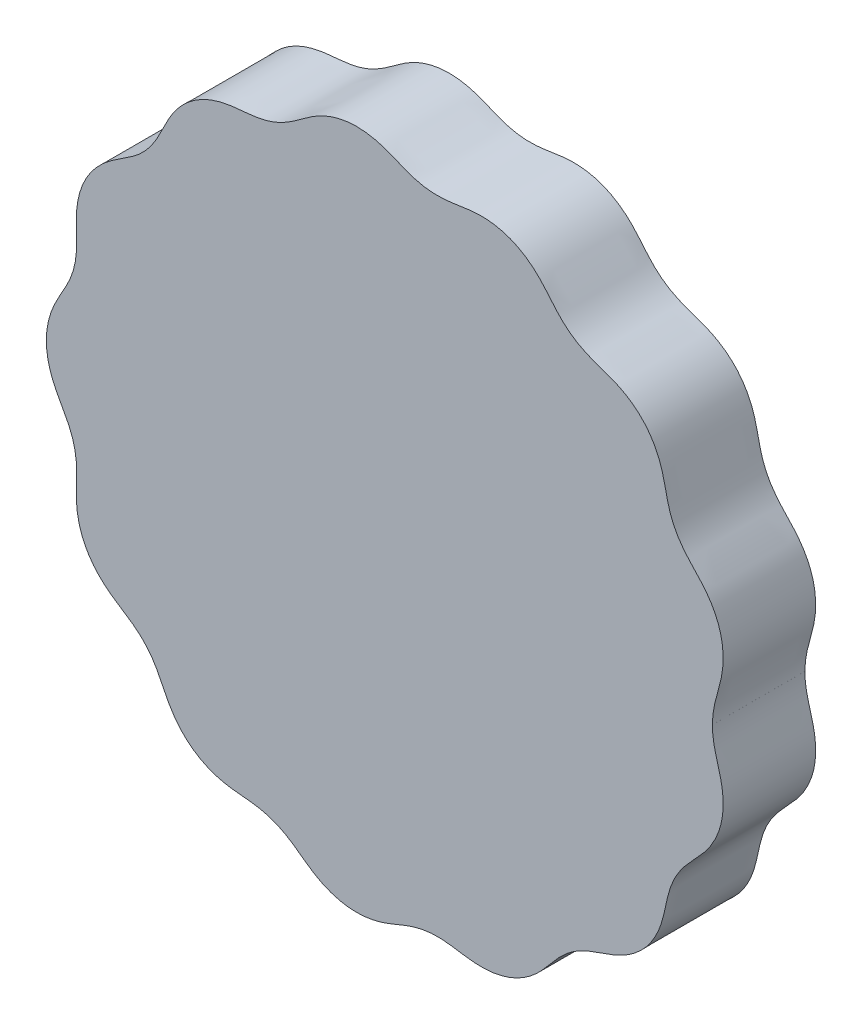
ISO-10303-21;
HEADER;
FILE_DESCRIPTION(('STEP AP214'),'2;1');
FILE_NAME('part.step','',(''),(''),'','','');
FILE_SCHEMA(('AUTOMOTIVE_DESIGN { 1 0 10303 214 1 1 1 1 }'));
ENDSEC;
DATA;
#1=APPLICATION_CONTEXT('core data for automotive mechanical design processes');
#2=APPLICATION_PROTOCOL_DEFINITION('international standard','automotive_design',2000,#1);
#3=PRODUCT_CONTEXT('',#1,'mechanical');
#4=PRODUCT('Part','Part','',(#3));
#5=PRODUCT_RELATED_PRODUCT_CATEGORY('part','',(#4));
#6=PRODUCT_DEFINITION_FORMATION('','',#4);
#7=PRODUCT_DEFINITION_CONTEXT('part definition',#1,'design');
#8=PRODUCT_DEFINITION('design','',#6,#7);
#9=PRODUCT_DEFINITION_SHAPE('','',#8);
#10=(LENGTH_UNIT() NAMED_UNIT(*) SI_UNIT(.MILLI.,.METRE.));
#11=(NAMED_UNIT(*) PLANE_ANGLE_UNIT() SI_UNIT($,.RADIAN.));
#12=(NAMED_UNIT(*) SI_UNIT($,.STERADIAN.) SOLID_ANGLE_UNIT());
#13=UNCERTAINTY_MEASURE_WITH_UNIT(LENGTH_MEASURE(1.E-05),#10,'distance_accuracy_value','');
#14=(GEOMETRIC_REPRESENTATION_CONTEXT(3) GLOBAL_UNCERTAINTY_ASSIGNED_CONTEXT((#13)) GLOBAL_UNIT_ASSIGNED_CONTEXT((#10,
#11,#12)) REPRESENTATION_CONTEXT('',''));
#15=CARTESIAN_POINT('',(0.,0.,0.));
#16=DIRECTION('',(0.,0.,1.));
#17=DIRECTION('',(1.,0.,0.));
#18=AXIS2_PLACEMENT_3D('',#15,#16,#17);
#19=CARTESIAN_POINT('',(35.,2.17512996089608E-13,10.));
#20=DIRECTION('',(-0.999999955000063,0.000299999786882255,0.));
#21=DIRECTION('',(-0.000299999786882255,-0.999999955000063,0.));
#22=AXIS2_PLACEMENT_3D('',#19,#20,#21);
#23=PLANE('',#22);
#24=CARTESIAN_POINT('',(35.,2.17512996089608E-13,0.));
#25=CARTESIAN_POINT('',(35.0000014999983,0.00499999781969133,0.));
#26=B_SPLINE_CURVE_WITH_KNOTS('',1,(#24,#25),.UNSPECIFIED.,.F.,.F.,(2,2),(0.,1.),.UNSPECIFIED.);
#27=CARTESIAN_POINT('',(35.,2.17512996089608E-13,0.));
#28=VERTEX_POINT('',#27);
#29=CARTESIAN_POINT('',(35.0000014999983,0.00499999782795079,0.));
#30=VERTEX_POINT('',#29);
#31=EDGE_CURVE('E78',#28,#30,#26,.T.);
#32=ORIENTED_EDGE('',*,*,#31,.T.);
#33=DIRECTION('',(0.,0.,-1.));
#34=VECTOR('',#33,1.);
#35=CARTESIAN_POINT('',(35.0000014999983,0.00499999782795079,10.));
#36=LINE('',#35,#34);
#37=CARTESIAN_POINT('',(35.0000014999983,0.00499999782795079,10.));
#38=VERTEX_POINT('',#37);
#39=EDGE_CURVE('E11',#38,#30,#36,.T.);
#40=ORIENTED_EDGE('',*,*,#39,.F.);
#41=CARTESIAN_POINT('',(35.,2.17512996089608E-13,10.));
#42=CARTESIAN_POINT('',(35.0000014999983,0.00499999781969133,10.));
#43=B_SPLINE_CURVE_WITH_KNOTS('',1,(#41,#42),.UNSPECIFIED.,.F.,.F.,(2,2),(0.,1.),.UNSPECIFIED.);
#44=CARTESIAN_POINT('',(35.,2.17512996089608E-13,10.));
#45=VERTEX_POINT('',#44);
#46=EDGE_CURVE('E77',#45,#38,#43,.T.);
#47=ORIENTED_EDGE('',*,*,#46,.F.);
#48=DIRECTION('',(0.,0.,-1.));
#49=VECTOR('',#48,1.);
#50=CARTESIAN_POINT('',(35.,2.17512996089608E-13,10.));
#51=LINE('',#50,#49);
#52=EDGE_CURVE('E54',#45,#28,#51,.T.);
#53=ORIENTED_EDGE('',*,*,#52,.T.);
#54=EDGE_LOOP('',(#32,#40,#47,#53));
#55=FACE_BOUND('',#54,.T.);
#56=ADVANCED_FACE('F45',(#55),#23,.F.);
#57=CARTESIAN_POINT('',(35.0000014999983,0.00499999782795079,10.));
#58=CARTESIAN_POINT('',(35.0000310864618,0.0543108155195717,10.));
#59=CARTESIAN_POINT('',(35.0009025407844,0.128549060653493,10.));
#60=CARTESIAN_POINT('',(35.0037411347304,0.265908238096289,10.));
#61=CARTESIAN_POINT('',(35.0112683029075,0.448861583052946,10.));
#62=CARTESIAN_POINT('',(35.0220480814165,0.620168406201716,10.));
#63=CARTESIAN_POINT('',(35.0442367557875,0.884014257720386,10.));
#64=CARTESIAN_POINT('',(35.0862856779514,1.23397754887106,10.));
#65=CARTESIAN_POINT('',(35.1523441183875,1.63943468512376,10.));
#66=CARTESIAN_POINT('',(35.2480692150812,2.09944703597927,10.));
#67=CARTESIAN_POINT('',(35.3875729991291,2.66962897608304,10.));
#68=CARTESIAN_POINT('',(35.5718921271036,3.3319542435631,10.));
#69=CARTESIAN_POINT('',(35.7869402357076,4.0898074605208,10.));
#70=CARTESIAN_POINT('',(35.9915566398992,4.95474960359177,10.));
#71=CARTESIAN_POINT('',(36.1284446900114,5.81623189838863,10.));
#72=CARTESIAN_POINT('',(36.182876803988,6.63884940584036,10.));
#73=CARTESIAN_POINT('',(36.1626584016344,7.4146536717609,10.));
#74=CARTESIAN_POINT('',(36.080240472637,8.13764245164843,10.));
#75=CARTESIAN_POINT('',(35.948917033752,8.80433600647678,10.));
#76=CARTESIAN_POINT('',(35.7176418279966,9.62161868918746,10.));
#77=CARTESIAN_POINT('',(35.3354424499233,10.5680855593853,10.));
#78=CARTESIAN_POINT('',(34.7785264622724,11.5480214899174,10.));
#79=CARTESIAN_POINT('',(34.0308039915622,12.5244552342241,10.));
#80=CARTESIAN_POINT('',(33.2428665774803,13.3788345461627,10.));
#81=CARTESIAN_POINT('',(32.4828013554596,14.169074794182,10.));
#82=CARTESIAN_POINT('',(31.726496934877,15.0531498535634,10.));
#83=CARTESIAN_POINT('',(31.0436916666455,16.0782714437892,10.));
#84=CARTESIAN_POINT('',(30.5295786030727,17.1993933760943,10.));
#85=CARTESIAN_POINT('',(30.1816613252553,18.3792756298374,10.));
#86=CARTESIAN_POINT('',(29.9429912197308,19.5166123580088,10.));
#87=CARTESIAN_POINT('',(29.71326611424,20.5890199443362,10.));
#88=CARTESIAN_POINT('',(29.293876673344,22.0328632068651,10.));
#89=CARTESIAN_POINT('',(28.4595191507792,23.7627677170157,10.));
#90=CARTESIAN_POINT('',(27.1929466300125,25.2322472754577,10.));
#91=CARTESIAN_POINT('',(25.6089374617144,26.3101838573324,10.));
#92=CARTESIAN_POINT('',(24.2456821647143,26.927775953026,10.));
#93=CARTESIAN_POINT('',(23.2220104942948,27.2939568668243,10.));
#94=CARTESIAN_POINT('',(22.1052345497009,27.6653491268592,10.));
#95=CARTESIAN_POINT('',(20.9288841623815,28.1421706873889,10.));
#96=CARTESIAN_POINT('',(19.5935757182385,28.9216372845436,10.));
#97=CARTESIAN_POINT('',(18.4486380278207,29.9664881873426,10.));
#98=CARTESIAN_POINT('',(17.5362778913035,31.0896072459109,10.));
#99=CARTESIAN_POINT('',(16.6157446691518,32.1840877397335,10.));
#100=CARTESIAN_POINT('',(15.7429026297886,33.0588471513226,10.));
#101=CARTESIAN_POINT('',(14.7030224949892,33.8498035211526,10.));
#102=CARTESIAN_POINT('',(13.4889971741319,34.4966066035768,10.));
#103=CARTESIAN_POINT('',(12.1240086493383,34.9572968684681,10.));
#104=CARTESIAN_POINT('',(10.6342597314615,35.1865550577604,10.));
#105=CARTESIAN_POINT('',(9.22904618966915,35.1535374118458,10.));
#106=CARTESIAN_POINT('',(7.94378723991389,34.9680349230072,10.));
#107=CARTESIAN_POINT('',(6.83150352352526,34.7908186476337,10.));
#108=CARTESIAN_POINT('',(5.88134624445465,34.6858590626975,10.));
#109=CARTESIAN_POINT('',(4.7366208813196,34.6630149305843,10.));
#110=CARTESIAN_POINT('',(3.40894171938031,34.8257184399033,10.));
#111=CARTESIAN_POINT('',(1.91709374042729,35.2896089270988,10.));
#112=CARTESIAN_POINT('',(0.303798344952442,36.0279394548844,10.));
#113=CARTESIAN_POINT('',(-1.61842807113981,36.6998094454582,10.));
#114=CARTESIAN_POINT('',(-3.57344713106737,36.8979502976926,10.));
#115=CARTESIAN_POINT('',(-5.3930353257133,36.6450814600355,10.));
#116=CARTESIAN_POINT('',(-6.93090405326019,36.0791709130417,10.));
#117=CARTESIAN_POINT('',(-8.01365765132078,35.495538514688,10.));
#118=CARTESIAN_POINT('',(-8.97311262350877,34.8385784922628,10.));
#119=CARTESIAN_POINT('',(-9.84765265841585,34.177822985542,10.));
#120=CARTESIAN_POINT('',(-10.7975945743944,33.5073076721959,10.));
#121=CARTESIAN_POINT('',(-11.8722535878071,32.9062263168151,10.));
#122=CARTESIAN_POINT('',(-13.0285594035672,32.4759919455254,10.));
#123=CARTESIAN_POINT('',(-14.234143790567,32.2257725627894,10.));
#124=CARTESIAN_POINT('',(-15.390573103576,32.1053174925648,10.));
#125=CARTESIAN_POINT('',(-16.4835526577881,32.0177130648229,10.));
#126=CARTESIAN_POINT('',(-17.9732275202098,31.8219670874056,10.));
#127=CARTESIAN_POINT('',(-19.8157911706481,31.2832586366021,10.));
#128=CARTESIAN_POINT('',(-21.448087560462,30.2928390578204,10.));
#129=CARTESIAN_POINT('',(-22.7368070226648,28.9589014916297,10.));
#130=CARTESIAN_POINT('',(-23.5268276569515,27.795754617945,10.));
#131=CARTESIAN_POINT('',(-23.996782169516,26.9508418240897,10.));
#132=CARTESIAN_POINT('',(-24.4890243428845,25.9340854528209,10.));
#133=CARTESIAN_POINT('',(-25.052171961089,24.7708946898695,10.));
#134=CARTESIAN_POINT('',(-25.753304669946,23.6667541107942,10.));
#135=CARTESIAN_POINT('',(-26.6421141795922,22.6971158668361,10.));
#136=CARTESIAN_POINT('',(-27.5340060178717,21.9616914109461,10.));
#137=CARTESIAN_POINT('',(-28.3591252213195,21.3964246691871,10.));
#138=CARTESIAN_POINT('',(-29.3206482840517,20.7893626430089,10.));
#139=CARTESIAN_POINT('',(-30.3764522165791,20.0710476460752,10.));
#140=CARTESIAN_POINT('',(-31.4056318689637,19.164101965325,10.));
#141=CARTESIAN_POINT('',(-32.3230035783964,18.0254330987503,10.));
#142=CARTESIAN_POINT('',(-33.0105859424613,16.7916127293966,10.));
#143=CARTESIAN_POINT('',(-33.4724653062054,15.5087803291539,10.));
#144=CARTESIAN_POINT('',(-33.713735096596,14.2340463592534,10.));
#145=CARTESIAN_POINT('',(-33.7797135021145,13.0062514445877,10.));
#146=CARTESIAN_POINT('',(-33.7460081766283,11.8447409720605,10.));
#147=CARTESIAN_POINT('',(-33.7061868322671,10.748767552727,10.));
#148=CARTESIAN_POINT('',(-33.7453548751316,9.57581663609641,10.));
#149=CARTESIAN_POINT('',(-33.9459758463393,8.34033054946759,10.));
#150=CARTESIAN_POINT('',(-34.3420470547459,7.1565545424737,10.));
#151=CARTESIAN_POINT('',(-34.8935147152783,6.04683841636418,10.));
#152=CARTESIAN_POINT('',(-35.4726688918044,5.04513400400629,10.));
#153=CARTESIAN_POINT('',(-35.992316197492,4.10126209590537,10.));
#154=CARTESIAN_POINT('',(-36.6040444386442,2.74351990933526,10.));
#155=CARTESIAN_POINT('',(-37.0819615481045,0.893241810429942,10.));
#156=CARTESIAN_POINT('',(-37.0651350039162,-1.04416304398527,10.));
#157=CARTESIAN_POINT('',(-36.5515003787192,-2.89476510792298,10.));
#158=CARTESIAN_POINT('',(-35.9130270447585,-4.25590172670625,10.));
#159=CARTESIAN_POINT('',(-35.3755715468699,-5.21161152733351,10.));
#160=CARTESIAN_POINT('',(-34.7987224561679,-6.22019930081547,10.));
#161=CARTESIAN_POINT('',(-34.2723005947744,-7.33179919523578,10.));
#162=CARTESIAN_POINT('',(-33.9075518356997,-8.51006516940914,10.));
#163=CARTESIAN_POINT('',(-33.7328044584287,-9.72956587013439,10.));
#164=CARTESIAN_POINT('',(-33.708623438649,-10.8930201193704,10.));
#165=CARTESIAN_POINT('',(-33.7526262945537,-11.9888014539399,10.));
#166=CARTESIAN_POINT('',(-33.7783656643995,-13.15077461867,10.));
#167=CARTESIAN_POINT('',(-33.6954628951965,-14.3778126612138,10.));
#168=CARTESIAN_POINT('',(-33.4332534316111,-15.648473232854,10.));
#169=CARTESIAN_POINT('',(-32.9493812308427,-16.9232332157588,10.));
#170=CARTESIAN_POINT('',(-32.231699609788,-18.1599708416635,10.));
#171=CARTESIAN_POINT('',(-31.2694098423721,-19.3075517549116,10.));
#172=CARTESIAN_POINT('',(-30.1989188317438,-20.2070112138374,10.));
#173=CARTESIAN_POINT('',(-29.1172913065484,-20.9169002608777,10.));
#174=CARTESIAN_POINT('',(-28.1653383806955,-21.523253444333,10.));
#175=CARTESIAN_POINT('',(-27.3778660454546,-22.0817554417611,10.));
#176=CARTESIAN_POINT('',(-26.5068800093264,-22.8288074681,10.));
#177=CARTESIAN_POINT('',(-25.6287598356217,-23.8316114418076,10.));
#178=CARTESIAN_POINT('',(-24.8245788946458,-25.167993152194,10.));
#179=CARTESIAN_POINT('',(-24.1070186348831,-26.7907272245746,10.));
#180=CARTESIAN_POINT('',(-23.1071251701615,-28.5704572223174,10.));
#181=CARTESIAN_POINT('',(-21.7615407347717,-30.0159408107248,10.));
#182=CARTESIAN_POINT('',(-20.2223560264506,-31.0273581583187,10.));
#183=CARTESIAN_POINT('',(-18.6927494842547,-31.6153340136885,10.));
#184=CARTESIAN_POINT('',(-17.4939020890828,-31.8907234185412,10.));
#185=CARTESIAN_POINT('',(-16.33954540693,-32.0314221135062,10.));
#186=CARTESIAN_POINT('',(-15.2466267232609,-32.1164510182547,10.));
#187=CARTESIAN_POINT('',(-14.091231922898,-32.2480274741547,10.));
#188=CARTESIAN_POINT('',(-12.8896521444052,-32.5169765767396,10.));
#189=CARTESIAN_POINT('',(-11.7416066413377,-32.9683768241079,10.));
#190=CARTESIAN_POINT('',(-10.6765692212953,-33.5856849111498,10.));
#191=CARTESIAN_POINT('',(-9.73303998733823,-34.2648006268558,10.));
#192=CARTESIAN_POINT('',(-8.85632765246375,-34.9233351774222,10.));
#193=CARTESIAN_POINT('',(-7.60841069792694,-35.760261885803,10.));
#194=CARTESIAN_POINT('',(-5.86757614412619,-36.5696316309667,10.));
#195=CARTESIAN_POINT('',(-3.98951327993847,-36.8998605471362,10.));
#196=CARTESIAN_POINT('',(-2.14590416709129,-36.7469147483421,10.));
#197=CARTESIAN_POINT('',(-0.79144709462863,-36.3968340459103,10.));
#198=CARTESIAN_POINT('',(0.11112449024193,-36.0773040482213,10.));
#199=CARTESIAN_POINT('',(1.15146887092432,-35.6431763128395,10.));
#200=CARTESIAN_POINT('',(2.34898034039108,-35.1449725208596,10.));
#201=CARTESIAN_POINT('',(3.61171756825218,-34.7856814511564,10.));
#202=CARTESIAN_POINT('',(4.92526664045478,-34.654901605023,10.));
#203=CARTESIAN_POINT('',(6.07783996478705,-34.7001367287002,10.));
#204=CARTESIAN_POINT('',(7.060772067155,-34.824590111216,10.));
#205=CARTESIAN_POINT('',(8.18067682712421,-35.0073224475818,10.));
#206=CARTESIAN_POINT('',(9.45244591698825,-35.1689468055806,10.));
#207=CARTESIAN_POINT('',(11.1722758280691,-35.1687530312044,10.));
#208=CARTESIAN_POINT('',(12.97397742405,-34.7586949822555,10.));
#209=CARTESIAN_POINT('',(14.6039682442951,-33.9567953622201,10.));
#210=CARTESIAN_POINT('',(15.9108107588923,-32.9109898728797,10.));
#211=CARTESIAN_POINT('',(16.7749564682938,-32.0038355006133,10.));
#212=CARTESIAN_POINT('',(17.5068108935931,-31.1169611521332,10.));
#213=CARTESIAN_POINT('',(18.1792636699781,-30.3102649329796,10.));
#214=CARTESIAN_POINT('',(18.9903623654321,-29.4694486362523,10.));
#215=CARTESIAN_POINT('',(19.9984041020392,-28.6659749356962,10.));
#216=CARTESIAN_POINT('',(21.1226427369116,-28.0488785181959,10.));
#217=CARTESIAN_POINT('',(22.3082413168059,-27.5963092065576,10.));
#218=CARTESIAN_POINT('',(23.6325547646824,-27.1562463134082,10.));
#219=CARTESIAN_POINT('',(25.220785613855,-26.5521642518819,10.));
#220=CARTESIAN_POINT('',(27.0395117153579,-25.4116636844367,10.));
#221=CARTESIAN_POINT('',(28.4621756891948,-23.7586196925762,10.));
#222=CARTESIAN_POINT('',(29.2958038582495,-22.0281480879799,10.));
#223=CARTESIAN_POINT('',(29.7143741475314,-20.5841796613305,10.));
#224=CARTESIAN_POINT('',(29.9440040608247,-19.511701744421,10.));
#225=CARTESIAN_POINT('',(30.1828014144426,-18.3744208770754,10.));
#226=CARTESIAN_POINT('',(30.5313438936794,-17.1946828005679,10.));
#227=CARTESIAN_POINT('',(31.0461225137016,-16.0738793719032,10.));
#228=CARTESIAN_POINT('',(31.7295565739188,-15.0491651960089,10.));
#229=CARTESIAN_POINT('',(32.4861941931094,-14.165404540366,10.));
#230=CARTESIAN_POINT('',(33.2463637604059,-13.3752515933604,10.));
#231=CARTESIAN_POINT('',(33.9189763417439,-12.6454506473698,10.));
#232=CARTESIAN_POINT('',(34.4713135650359,-11.9491040909517,10.));
#233=CARTESIAN_POINT('',(34.9068670410096,-11.2974537143156,10.));
#234=CARTESIAN_POINT('',(35.2412742647242,-10.705998089152,10.));
#235=CARTESIAN_POINT('',(35.6002746812378,-9.93630286625626,10.));
#236=CARTESIAN_POINT('',(35.8755665725315,-9.13146148457562,10.));
#237=CARTESIAN_POINT('',(36.0618650684503,-8.30148007360115,10.));
#238=CARTESIAN_POINT('',(36.1629952014171,-7.40965964100821,10.));
#239=CARTESIAN_POINT('',(36.1827638728428,-6.63383724796177,10.));
#240=CARTESIAN_POINT('',(36.1278719749925,-5.81126275899116,10.));
#241=CARTESIAN_POINT('',(35.9905738114838,-4.94983765098203,10.));
#242=CARTESIAN_POINT('',(35.8127203748505,-4.19930319023177,10.));
#243=CARTESIAN_POINT('',(35.6346423525472,-3.55299844431831,10.));
#244=CARTESIAN_POINT('',(35.4806577472858,-3.0041630874605,10.));
#245=CARTESIAN_POINT('',(35.3584335685775,-2.55079150981114,10.));
#246=CARTESIAN_POINT('',(35.2469484750016,-2.09447422513157,10.));
#247=CARTESIAN_POINT('',(35.1633729243929,-1.69220335621169,10.));
#248=CARTESIAN_POINT('',(35.1043890938049,-1.34468882390954,10.));
#249=CARTESIAN_POINT('',(35.064644020595,-1.05422526503456,10.));
#250=CARTESIAN_POINT('',(35.0388223524986,-0.820246291414608,10.));
#251=CARTESIAN_POINT('',(35.0216800303736,-0.615246909389165,10.));
#252=CARTESIAN_POINT('',(35.0110017645867,-0.443866873314605,10.));
#253=CARTESIAN_POINT('',(35.0035833396059,-0.260905707937618,10.));
#254=CARTESIAN_POINT('',(35.0008269251787,-0.123549040932127,10.));
#255=CARTESIAN_POINT('',(35.,-0.0493109335059125,10.));
#256=CARTESIAN_POINT('',(35.,2.17512996089608E-13,10.));
#257=B_SPLINE_CURVE_WITH_KNOTS('',4,(#57,#58,#59,#60,#61,#62,#63,#64,#65,#66,#67,#68,#69,#70,
#71,#72,#73,#74,#75,#76,#77,#78,#79,#80,#81,#82,#83,#84,#85,#86,#87,#88,#89,#90,#91,#92,#93,#94,
#95,#96,#97,#98,#99,#100,#101,#102,#103,#104,#105,#106,#107,#108,#109,#110,#111,#112,#113,#114,
#115,#116,#117,#118,#119,#120,#121,#122,#123,#124,#125,#126,#127,#128,#129,#130,#131,#132,#133,
#134,#135,#136,#137,#138,#139,#140,#141,#142,#143,#144,#145,#146,#147,#148,#149,#150,#151,#152,
#153,#154,#155,#156,#157,#158,#159,#160,#161,#162,#163,#164,#165,#166,#167,#168,#169,#170,#171,
#172,#173,#174,#175,#176,#177,#178,#179,#180,#181,#182,#183,#184,#185,#186,#187,#188,#189,#190,
#191,#192,#193,#194,#195,#196,#197,#198,#199,#200,#201,#202,#203,#204,#205,#206,#207,#208,#209,
#210,#211,#212,#213,#214,#215,#216,#217,#218,#219,#220,#221,#222,#223,#224,#225,#226,#227,#228,
#229,#230,#231,#232,#233,#234,#235,#236,#237,#238,#239,#240,#241,#242,#243,#244,#245,#246,#247,
#248,#249,#250,#251,#252,#253,#254,#255,#256),.UNSPECIFIED.,.F.,.F.,(5,1,1,1,1,1,1,1,1,1,1,1,1,
1,1,1,1,1,1,1,1,1,1,1,1,1,1,1,1,1,1,1,1,1,1,1,1,1,1,1,1,1,1,1,1,1,1,1,1,1,1,1,1,1,1,1,1,1,1,1,1,
1,1,1,1,1,1,1,1,1,1,1,1,1,1,1,1,1,1,1,1,1,1,1,1,1,1,1,1,1,1,1,1,1,1,1,1,1,1,1,1,1,1,1,1,1,1,1,1,
1,1,1,1,1,1,1,1,1,1,1,1,1,1,1,1,1,1,1,1,1,1,1,1,1,1,1,1,1,1,1,1,1,1,1,1,1,1,1,1,1,1,1,1,1,1,1,1,
1,1,1,1,1,1,1,1,1,1,1,1,1,1,1,1,1,1,1,1,1,1,1,1,1,1,1,1,1,1,1,1,1,1,1,1,1,1,1,5),
(0.0799585139855253,0.0808016319208815,0.0812231908885596,0.0816447498562378,0.0824878677915939,
0.0833309857269501,0.0850172215976625,0.0867034574683749,0.0883896933390872,0.0900759292097996,
0.0934484009512245,0.0965769836923111,0.0997055664333978,0.102834149174485,0.105962731915571,
0.108400079205186,0.1108374264948,0.113274773784414,0.115712121074028,0.120586715487781,
0.125461309901534,0.129398913920264,0.133336517938994,0.137274121957724,0.141211725976454,
0.146089496466122,0.150967266955791,0.154905132702594,0.158842998449398,0.162780864196202,
0.166718729943005,0.17646831731985,0.186217717984959,0.190120483258056,0.194023248531152,
0.197926013804249,0.201828779077345,0.207026840224401,0.212224901371457,0.22001521017182,
0.223910364572001,0.227805518972182,0.232765237978891,0.237724956985599,0.242599963908352,
0.247474970831104,0.253367505521141,0.259260040211178,0.262689444006252,0.266118847801326,
0.2695482515964,0.272977655391473,0.279107821832224,0.285237988272975,0.291859619303993,
0.298481250335011,0.30823107284623,0.313105661793932,0.317980250741635,0.321917090798989,
0.325853930856342,0.329790770913696,0.33372761097105,0.338607669360939,0.343487727750829,
0.347425365979876,0.351363004208924,0.355300642437972,0.359238280667019,0.368987196367673,
0.378737424337697,0.382206736502514,0.38567604866733,0.389145360832147,0.392614672996963,
0.398428142830532,0.4042416126641,0.407829818189618,0.411418023715136,0.415006229240653,
0.418594434766171,0.424168718030764,0.429743001295357,0.434618078686967,0.439493156078577,
0.444367348143028,0.44924154020748,0.453179495085498,0.457117449963517,0.461055404841536,
0.464993359719555,0.470010993870121,0.475028628020687,0.478896540536463,0.482764453052239,
0.486632365568014,0.49050027808379,0.500249319388915,0.509999725585423,0.513936497203497,
0.517873268821572,0.521810040439646,0.525746812057721,0.530625329588118,0.535503847118515,
0.539442120879076,0.543380394639637,0.547318668400198,0.551256942160759,0.556130994705138,
0.561005047249517,0.565880157221534,0.570755267193551,0.576579676598519,0.582404086003487,
0.585867379780145,0.589330673556802,0.59279396733346,0.596257261110118,0.602320532403235,
0.608383803696352,0.615072970052813,0.621762136409274,0.631511329997131,0.636386171720147,
0.641261013443163,0.645198396544707,0.649135779646252,0.653073162747797,0.657010545849342,
0.66188932723368,0.666768108618019,0.670705714132,0.674643319645982,0.678580925159963,
0.682518530673944,0.692267317749968,0.702017266080071,0.705453144308102,0.708889022536133,
0.712324900764163,0.715760778992194,0.72164104154116,0.727521304090127,0.731075750408198,
0.73463019672627,0.738184643044341,0.741739089362412,0.747381555612382,0.753024021862351,
0.762773254432937,0.767983355061395,0.773193455689854,0.776963292337629,0.780733128985404,
0.78450296563318,0.788272802280955,0.793721664853404,0.799170527425852,0.802822956359205,
0.806475385292558,0.813780243159264,0.823529657069871,0.833279231961539,0.837217092894277,
0.841154953827014,0.845092814759752,0.84903067569249,0.853908470254846,0.858786264817202,
0.862723861245354,0.866661457673505,0.870599054101657,0.874536650529809,0.876973948868325,
0.87941124720684,0.881848545545356,0.884285843883872,0.889160546087531,0.89159789718936,
0.89403524829119,0.897163821452413,0.900292394613637,0.903420967774861,0.906549540936085,
0.908235780463324,0.909922019990563,0.911608259517802,0.913294499045041,0.914980738572281,
0.9158238583359,0.91666697809952,0.917510097863139,0.918353217626759,0.918774777508569,
0.919196337390379,0.920039457153998),.UNSPECIFIED.);
#258=DIRECTION('',(0.,0.,-1.));
#259=VECTOR('',#258,1.);
#260=SURFACE_OF_LINEAR_EXTRUSION('',#257,#259);
#261=CARTESIAN_POINT('',(35.0000014999983,0.00499999782795079,0.));
#262=CARTESIAN_POINT('',(35.0000310864618,0.0543108155195717,0.));
#263=CARTESIAN_POINT('',(35.0009025407844,0.128549060653493,0.));
#264=CARTESIAN_POINT('',(35.0037411347304,0.265908238096289,0.));
#265=CARTESIAN_POINT('',(35.0112683029075,0.448861583052946,0.));
#266=CARTESIAN_POINT('',(35.0220480814165,0.620168406201716,0.));
#267=CARTESIAN_POINT('',(35.0442367557875,0.884014257720386,0.));
#268=CARTESIAN_POINT('',(35.0862856779514,1.23397754887106,0.));
#269=CARTESIAN_POINT('',(35.1523441183875,1.63943468512376,0.));
#270=CARTESIAN_POINT('',(35.2480692150812,2.09944703597927,0.));
#271=CARTESIAN_POINT('',(35.3875729991291,2.66962897608304,0.));
#272=CARTESIAN_POINT('',(35.5718921271036,3.3319542435631,0.));
#273=CARTESIAN_POINT('',(35.7869402357076,4.0898074605208,0.));
#274=CARTESIAN_POINT('',(35.9915566398992,4.95474960359177,0.));
#275=CARTESIAN_POINT('',(36.1284446900114,5.81623189838863,0.));
#276=CARTESIAN_POINT('',(36.182876803988,6.63884940584036,0.));
#277=CARTESIAN_POINT('',(36.1626584016344,7.4146536717609,0.));
#278=CARTESIAN_POINT('',(36.080240472637,8.13764245164843,0.));
#279=CARTESIAN_POINT('',(35.948917033752,8.80433600647678,0.));
#280=CARTESIAN_POINT('',(35.7176418279966,9.62161868918746,0.));
#281=CARTESIAN_POINT('',(35.3354424499233,10.5680855593853,0.));
#282=CARTESIAN_POINT('',(34.7785264622724,11.5480214899174,0.));
#283=CARTESIAN_POINT('',(34.0308039915622,12.5244552342241,0.));
#284=CARTESIAN_POINT('',(33.2428665774803,13.3788345461627,0.));
#285=CARTESIAN_POINT('',(32.4828013554596,14.169074794182,0.));
#286=CARTESIAN_POINT('',(31.726496934877,15.0531498535634,0.));
#287=CARTESIAN_POINT('',(31.0436916666455,16.0782714437892,0.));
#288=CARTESIAN_POINT('',(30.5295786030727,17.1993933760943,0.));
#289=CARTESIAN_POINT('',(30.1816613252553,18.3792756298374,0.));
#290=CARTESIAN_POINT('',(29.9429912197308,19.5166123580088,0.));
#291=CARTESIAN_POINT('',(29.71326611424,20.5890199443362,0.));
#292=CARTESIAN_POINT('',(29.293876673344,22.0328632068651,0.));
#293=CARTESIAN_POINT('',(28.4595191507792,23.7627677170157,0.));
#294=CARTESIAN_POINT('',(27.1929466300125,25.2322472754577,0.));
#295=CARTESIAN_POINT('',(25.6089374617144,26.3101838573324,0.));
#296=CARTESIAN_POINT('',(24.2456821647143,26.927775953026,0.));
#297=CARTESIAN_POINT('',(23.2220104942948,27.2939568668243,0.));
#298=CARTESIAN_POINT('',(22.1052345497009,27.6653491268592,0.));
#299=CARTESIAN_POINT('',(20.9288841623815,28.1421706873889,0.));
#300=CARTESIAN_POINT('',(19.5935757182385,28.9216372845436,0.));
#301=CARTESIAN_POINT('',(18.4486380278207,29.9664881873426,0.));
#302=CARTESIAN_POINT('',(17.5362778913035,31.0896072459109,0.));
#303=CARTESIAN_POINT('',(16.6157446691518,32.1840877397335,0.));
#304=CARTESIAN_POINT('',(15.7429026297886,33.0588471513226,0.));
#305=CARTESIAN_POINT('',(14.7030224949892,33.8498035211526,0.));
#306=CARTESIAN_POINT('',(13.4889971741319,34.4966066035768,0.));
#307=CARTESIAN_POINT('',(12.1240086493383,34.9572968684681,0.));
#308=CARTESIAN_POINT('',(10.6342597314615,35.1865550577604,0.));
#309=CARTESIAN_POINT('',(9.22904618966915,35.1535374118458,0.));
#310=CARTESIAN_POINT('',(7.94378723991389,34.9680349230072,0.));
#311=CARTESIAN_POINT('',(6.83150352352526,34.7908186476337,0.));
#312=CARTESIAN_POINT('',(5.88134624445465,34.6858590626975,0.));
#313=CARTESIAN_POINT('',(4.7366208813196,34.6630149305843,0.));
#314=CARTESIAN_POINT('',(3.40894171938031,34.8257184399033,0.));
#315=CARTESIAN_POINT('',(1.91709374042729,35.2896089270988,0.));
#316=CARTESIAN_POINT('',(0.303798344952442,36.0279394548844,0.));
#317=CARTESIAN_POINT('',(-1.61842807113981,36.6998094454582,0.));
#318=CARTESIAN_POINT('',(-3.57344713106737,36.8979502976926,0.));
#319=CARTESIAN_POINT('',(-5.3930353257133,36.6450814600355,0.));
#320=CARTESIAN_POINT('',(-6.93090405326019,36.0791709130417,0.));
#321=CARTESIAN_POINT('',(-8.01365765132078,35.495538514688,0.));
#322=CARTESIAN_POINT('',(-8.97311262350877,34.8385784922628,0.));
#323=CARTESIAN_POINT('',(-9.84765265841585,34.177822985542,0.));
#324=CARTESIAN_POINT('',(-10.7975945743944,33.5073076721959,0.));
#325=CARTESIAN_POINT('',(-11.8722535878071,32.9062263168151,0.));
#326=CARTESIAN_POINT('',(-13.0285594035672,32.4759919455254,0.));
#327=CARTESIAN_POINT('',(-14.234143790567,32.2257725627894,0.));
#328=CARTESIAN_POINT('',(-15.390573103576,32.1053174925648,0.));
#329=CARTESIAN_POINT('',(-16.4835526577881,32.0177130648229,0.));
#330=CARTESIAN_POINT('',(-17.9732275202098,31.8219670874056,0.));
#331=CARTESIAN_POINT('',(-19.8157911706481,31.2832586366021,0.));
#332=CARTESIAN_POINT('',(-21.448087560462,30.2928390578204,0.));
#333=CARTESIAN_POINT('',(-22.7368070226648,28.9589014916297,0.));
#334=CARTESIAN_POINT('',(-23.5268276569515,27.795754617945,0.));
#335=CARTESIAN_POINT('',(-23.996782169516,26.9508418240897,0.));
#336=CARTESIAN_POINT('',(-24.4890243428845,25.9340854528209,0.));
#337=CARTESIAN_POINT('',(-25.052171961089,24.7708946898695,0.));
#338=CARTESIAN_POINT('',(-25.753304669946,23.6667541107942,0.));
#339=CARTESIAN_POINT('',(-26.6421141795922,22.6971158668361,0.));
#340=CARTESIAN_POINT('',(-27.5340060178717,21.9616914109461,0.));
#341=CARTESIAN_POINT('',(-28.3591252213195,21.3964246691871,0.));
#342=CARTESIAN_POINT('',(-29.3206482840517,20.7893626430089,0.));
#343=CARTESIAN_POINT('',(-30.3764522165791,20.0710476460752,0.));
#344=CARTESIAN_POINT('',(-31.4056318689637,19.164101965325,0.));
#345=CARTESIAN_POINT('',(-32.3230035783964,18.0254330987503,0.));
#346=CARTESIAN_POINT('',(-33.0105859424613,16.7916127293966,0.));
#347=CARTESIAN_POINT('',(-33.4724653062054,15.5087803291539,0.));
#348=CARTESIAN_POINT('',(-33.713735096596,14.2340463592534,0.));
#349=CARTESIAN_POINT('',(-33.7797135021145,13.0062514445877,0.));
#350=CARTESIAN_POINT('',(-33.7460081766283,11.8447409720605,0.));
#351=CARTESIAN_POINT('',(-33.7061868322671,10.748767552727,0.));
#352=CARTESIAN_POINT('',(-33.7453548751316,9.57581663609641,0.));
#353=CARTESIAN_POINT('',(-33.9459758463393,8.34033054946759,0.));
#354=CARTESIAN_POINT('',(-34.3420470547459,7.1565545424737,0.));
#355=CARTESIAN_POINT('',(-34.8935147152783,6.04683841636418,0.));
#356=CARTESIAN_POINT('',(-35.4726688918044,5.04513400400629,0.));
#357=CARTESIAN_POINT('',(-35.992316197492,4.10126209590537,0.));
#358=CARTESIAN_POINT('',(-36.6040444386442,2.74351990933526,0.));
#359=CARTESIAN_POINT('',(-37.0819615481045,0.893241810429942,0.));
#360=CARTESIAN_POINT('',(-37.0651350039162,-1.04416304398527,0.));
#361=CARTESIAN_POINT('',(-36.5515003787192,-2.89476510792298,0.));
#362=CARTESIAN_POINT('',(-35.9130270447585,-4.25590172670625,0.));
#363=CARTESIAN_POINT('',(-35.3755715468699,-5.21161152733351,0.));
#364=CARTESIAN_POINT('',(-34.7987224561679,-6.22019930081547,0.));
#365=CARTESIAN_POINT('',(-34.2723005947744,-7.33179919523578,0.));
#366=CARTESIAN_POINT('',(-33.9075518356997,-8.51006516940914,0.));
#367=CARTESIAN_POINT('',(-33.7328044584287,-9.72956587013439,0.));
#368=CARTESIAN_POINT('',(-33.708623438649,-10.8930201193704,0.));
#369=CARTESIAN_POINT('',(-33.7526262945537,-11.9888014539399,0.));
#370=CARTESIAN_POINT('',(-33.7783656643995,-13.15077461867,0.));
#371=CARTESIAN_POINT('',(-33.6954628951965,-14.3778126612138,0.));
#372=CARTESIAN_POINT('',(-33.4332534316111,-15.648473232854,0.));
#373=CARTESIAN_POINT('',(-32.9493812308427,-16.9232332157588,0.));
#374=CARTESIAN_POINT('',(-32.231699609788,-18.1599708416635,0.));
#375=CARTESIAN_POINT('',(-31.2694098423721,-19.3075517549116,0.));
#376=CARTESIAN_POINT('',(-30.1989188317438,-20.2070112138374,0.));
#377=CARTESIAN_POINT('',(-29.1172913065484,-20.9169002608777,0.));
#378=CARTESIAN_POINT('',(-28.1653383806955,-21.523253444333,0.));
#379=CARTESIAN_POINT('',(-27.3778660454546,-22.0817554417611,0.));
#380=CARTESIAN_POINT('',(-26.5068800093264,-22.8288074681,0.));
#381=CARTESIAN_POINT('',(-25.6287598356217,-23.8316114418076,0.));
#382=CARTESIAN_POINT('',(-24.8245788946458,-25.167993152194,0.));
#383=CARTESIAN_POINT('',(-24.1070186348831,-26.7907272245746,0.));
#384=CARTESIAN_POINT('',(-23.1071251701615,-28.5704572223174,0.));
#385=CARTESIAN_POINT('',(-21.7615407347717,-30.0159408107248,0.));
#386=CARTESIAN_POINT('',(-20.2223560264506,-31.0273581583187,0.));
#387=CARTESIAN_POINT('',(-18.6927494842547,-31.6153340136885,0.));
#388=CARTESIAN_POINT('',(-17.4939020890828,-31.8907234185412,0.));
#389=CARTESIAN_POINT('',(-16.33954540693,-32.0314221135062,0.));
#390=CARTESIAN_POINT('',(-15.2466267232609,-32.1164510182547,0.));
#391=CARTESIAN_POINT('',(-14.091231922898,-32.2480274741547,0.));
#392=CARTESIAN_POINT('',(-12.8896521444052,-32.5169765767396,0.));
#393=CARTESIAN_POINT('',(-11.7416066413377,-32.9683768241079,0.));
#394=CARTESIAN_POINT('',(-10.6765692212953,-33.5856849111498,0.));
#395=CARTESIAN_POINT('',(-9.73303998733823,-34.2648006268558,0.));
#396=CARTESIAN_POINT('',(-8.85632765246375,-34.9233351774222,0.));
#397=CARTESIAN_POINT('',(-7.60841069792694,-35.760261885803,0.));
#398=CARTESIAN_POINT('',(-5.86757614412619,-36.5696316309667,0.));
#399=CARTESIAN_POINT('',(-3.98951327993847,-36.8998605471362,0.));
#400=CARTESIAN_POINT('',(-2.14590416709129,-36.7469147483421,0.));
#401=CARTESIAN_POINT('',(-0.79144709462863,-36.3968340459103,0.));
#402=CARTESIAN_POINT('',(0.11112449024193,-36.0773040482213,0.));
#403=CARTESIAN_POINT('',(1.15146887092432,-35.6431763128395,0.));
#404=CARTESIAN_POINT('',(2.34898034039108,-35.1449725208596,0.));
#405=CARTESIAN_POINT('',(3.61171756825218,-34.7856814511564,0.));
#406=CARTESIAN_POINT('',(4.92526664045478,-34.654901605023,0.));
#407=CARTESIAN_POINT('',(6.07783996478705,-34.7001367287002,0.));
#408=CARTESIAN_POINT('',(7.060772067155,-34.824590111216,0.));
#409=CARTESIAN_POINT('',(8.18067682712421,-35.0073224475818,0.));
#410=CARTESIAN_POINT('',(9.45244591698825,-35.1689468055806,0.));
#411=CARTESIAN_POINT('',(11.1722758280691,-35.1687530312044,0.));
#412=CARTESIAN_POINT('',(12.97397742405,-34.7586949822555,0.));
#413=CARTESIAN_POINT('',(14.6039682442951,-33.9567953622201,0.));
#414=CARTESIAN_POINT('',(15.9108107588923,-32.9109898728797,0.));
#415=CARTESIAN_POINT('',(16.7749564682938,-32.0038355006133,0.));
#416=CARTESIAN_POINT('',(17.5068108935931,-31.1169611521332,0.));
#417=CARTESIAN_POINT('',(18.1792636699781,-30.3102649329796,0.));
#418=CARTESIAN_POINT('',(18.9903623654321,-29.4694486362523,0.));
#419=CARTESIAN_POINT('',(19.9984041020392,-28.6659749356962,0.));
#420=CARTESIAN_POINT('',(21.1226427369116,-28.0488785181959,0.));
#421=CARTESIAN_POINT('',(22.3082413168059,-27.5963092065576,0.));
#422=CARTESIAN_POINT('',(23.6325547646824,-27.1562463134082,0.));
#423=CARTESIAN_POINT('',(25.220785613855,-26.5521642518819,0.));
#424=CARTESIAN_POINT('',(27.0395117153579,-25.4116636844367,0.));
#425=CARTESIAN_POINT('',(28.4621756891948,-23.7586196925762,0.));
#426=CARTESIAN_POINT('',(29.2958038582495,-22.0281480879799,0.));
#427=CARTESIAN_POINT('',(29.7143741475314,-20.5841796613305,0.));
#428=CARTESIAN_POINT('',(29.9440040608247,-19.511701744421,0.));
#429=CARTESIAN_POINT('',(30.1828014144426,-18.3744208770754,0.));
#430=CARTESIAN_POINT('',(30.5313438936794,-17.1946828005679,0.));
#431=CARTESIAN_POINT('',(31.0461225137016,-16.0738793719032,0.));
#432=CARTESIAN_POINT('',(31.7295565739188,-15.0491651960089,0.));
#433=CARTESIAN_POINT('',(32.4861941931094,-14.165404540366,0.));
#434=CARTESIAN_POINT('',(33.2463637604059,-13.3752515933604,0.));
#435=CARTESIAN_POINT('',(33.9189763417439,-12.6454506473698,0.));
#436=CARTESIAN_POINT('',(34.4713135650359,-11.9491040909517,0.));
#437=CARTESIAN_POINT('',(34.9068670410096,-11.2974537143156,0.));
#438=CARTESIAN_POINT('',(35.2412742647242,-10.705998089152,0.));
#439=CARTESIAN_POINT('',(35.6002746812378,-9.93630286625626,0.));
#440=CARTESIAN_POINT('',(35.8755665725315,-9.13146148457562,0.));
#441=CARTESIAN_POINT('',(36.0618650684503,-8.30148007360115,0.));
#442=CARTESIAN_POINT('',(36.1629952014171,-7.40965964100821,0.));
#443=CARTESIAN_POINT('',(36.1827638728428,-6.63383724796177,0.));
#444=CARTESIAN_POINT('',(36.1278719749925,-5.81126275899116,0.));
#445=CARTESIAN_POINT('',(35.9905738114838,-4.94983765098203,0.));
#446=CARTESIAN_POINT('',(35.8127203748505,-4.19930319023177,0.));
#447=CARTESIAN_POINT('',(35.6346423525472,-3.55299844431831,0.));
#448=CARTESIAN_POINT('',(35.4806577472858,-3.0041630874605,0.));
#449=CARTESIAN_POINT('',(35.3584335685775,-2.55079150981114,0.));
#450=CARTESIAN_POINT('',(35.2469484750016,-2.09447422513157,0.));
#451=CARTESIAN_POINT('',(35.1633729243929,-1.69220335621169,0.));
#452=CARTESIAN_POINT('',(35.1043890938049,-1.34468882390954,0.));
#453=CARTESIAN_POINT('',(35.064644020595,-1.05422526503456,0.));
#454=CARTESIAN_POINT('',(35.0388223524986,-0.820246291414608,0.));
#455=CARTESIAN_POINT('',(35.0216800303736,-0.615246909389165,0.));
#456=CARTESIAN_POINT('',(35.0110017645867,-0.443866873314605,0.));
#457=CARTESIAN_POINT('',(35.0035833396059,-0.260905707937618,0.));
#458=CARTESIAN_POINT('',(35.0008269251787,-0.123549040932127,0.));
#459=CARTESIAN_POINT('',(35.,-0.0493109335059125,0.));
#460=CARTESIAN_POINT('',(35.,2.17512996089608E-13,0.));
#461=B_SPLINE_CURVE_WITH_KNOTS('',4,(#261,#262,#263,#264,#265,#266,#267,#268,#269,#270,#271,
#272,#273,#274,#275,#276,#277,#278,#279,#280,#281,#282,#283,#284,#285,#286,#287,#288,#289,#290,
#291,#292,#293,#294,#295,#296,#297,#298,#299,#300,#301,#302,#303,#304,#305,#306,#307,#308,#309,
#310,#311,#312,#313,#314,#315,#316,#317,#318,#319,#320,#321,#322,#323,#324,#325,#326,#327,#328,
#329,#330,#331,#332,#333,#334,#335,#336,#337,#338,#339,#340,#341,#342,#343,#344,#345,#346,#347,
#348,#349,#350,#351,#352,#353,#354,#355,#356,#357,#358,#359,#360,#361,#362,#363,#364,#365,#366,
#367,#368,#369,#370,#371,#372,#373,#374,#375,#376,#377,#378,#379,#380,#381,#382,#383,#384,#385,
#386,#387,#388,#389,#390,#391,#392,#393,#394,#395,#396,#397,#398,#399,#400,#401,#402,#403,#404,
#405,#406,#407,#408,#409,#410,#411,#412,#413,#414,#415,#416,#417,#418,#419,#420,#421,#422,#423,
#424,#425,#426,#427,#428,#429,#430,#431,#432,#433,#434,#435,#436,#437,#438,#439,#440,#441,#442,
#443,#444,#445,#446,#447,#448,#449,#450,#451,#452,#453,#454,#455,#456,#457,#458,#459,#460),
.UNSPECIFIED.,.F.,.F.,(5,1,1,1,1,1,1,1,1,1,1,1,1,1,1,1,1,1,1,1,1,1,1,1,1,1,1,1,1,1,1,1,1,1,1,1,
1,1,1,1,1,1,1,1,1,1,1,1,1,1,1,1,1,1,1,1,1,1,1,1,1,1,1,1,1,1,1,1,1,1,1,1,1,1,1,1,1,1,1,1,1,1,1,1,
1,1,1,1,1,1,1,1,1,1,1,1,1,1,1,1,1,1,1,1,1,1,1,1,1,1,1,1,1,1,1,1,1,1,1,1,1,1,1,1,1,1,1,1,1,1,1,1,
1,1,1,1,1,1,1,1,1,1,1,1,1,1,1,1,1,1,1,1,1,1,1,1,1,1,1,1,1,1,1,1,1,1,1,1,1,1,1,1,1,1,1,1,1,1,1,1,
1,1,1,1,1,1,1,1,1,1,1,1,1,1,1,1,5),(0.0799585139855253,0.0808016319208815,0.0812231908885596,
0.0816447498562378,0.0824878677915939,0.0833309857269501,0.0850172215976625,0.0867034574683749,
0.0883896933390872,0.0900759292097996,0.0934484009512245,0.0965769836923111,0.0997055664333978,
0.102834149174485,0.105962731915571,0.108400079205186,0.1108374264948,0.113274773784414,
0.115712121074028,0.120586715487781,0.125461309901534,0.129398913920264,0.133336517938994,
0.137274121957724,0.141211725976454,0.146089496466122,0.150967266955791,0.154905132702594,
0.158842998449398,0.162780864196202,0.166718729943005,0.17646831731985,0.186217717984959,
0.190120483258056,0.194023248531152,0.197926013804249,0.201828779077345,0.207026840224401,
0.212224901371457,0.22001521017182,0.223910364572001,0.227805518972182,0.232765237978891,
0.237724956985599,0.242599963908352,0.247474970831104,0.253367505521141,0.259260040211178,
0.262689444006252,0.266118847801326,0.2695482515964,0.272977655391473,0.279107821832224,
0.285237988272975,0.291859619303993,0.298481250335011,0.30823107284623,0.313105661793932,
0.317980250741635,0.321917090798989,0.325853930856342,0.329790770913696,0.33372761097105,
0.338607669360939,0.343487727750829,0.347425365979876,0.351363004208924,0.355300642437972,
0.359238280667019,0.368987196367673,0.378737424337697,0.382206736502514,0.38567604866733,
0.389145360832147,0.392614672996963,0.398428142830532,0.4042416126641,0.407829818189618,
0.411418023715136,0.415006229240653,0.418594434766171,0.424168718030764,0.429743001295357,
0.434618078686967,0.439493156078577,0.444367348143028,0.44924154020748,0.453179495085498,
0.457117449963517,0.461055404841536,0.464993359719555,0.470010993870121,0.475028628020687,
0.478896540536463,0.482764453052239,0.486632365568014,0.49050027808379,0.500249319388915,
0.509999725585423,0.513936497203497,0.517873268821572,0.521810040439646,0.525746812057721,
0.530625329588118,0.535503847118515,0.539442120879076,0.543380394639637,0.547318668400198,
0.551256942160759,0.556130994705138,0.561005047249517,0.565880157221534,0.570755267193551,
0.576579676598519,0.582404086003487,0.585867379780145,0.589330673556802,0.59279396733346,
0.596257261110118,0.602320532403235,0.608383803696352,0.615072970052813,0.621762136409274,
0.631511329997131,0.636386171720147,0.641261013443163,0.645198396544707,0.649135779646252,
0.653073162747797,0.657010545849342,0.66188932723368,0.666768108618019,0.670705714132,
0.674643319645982,0.678580925159963,0.682518530673944,0.692267317749968,0.702017266080071,
0.705453144308102,0.708889022536133,0.712324900764163,0.715760778992194,0.72164104154116,
0.727521304090127,0.731075750408198,0.73463019672627,0.738184643044341,0.741739089362412,
0.747381555612382,0.753024021862351,0.762773254432937,0.767983355061395,0.773193455689854,
0.776963292337629,0.780733128985404,0.78450296563318,0.788272802280955,0.793721664853404,
0.799170527425852,0.802822956359205,0.806475385292558,0.813780243159264,0.823529657069871,
0.833279231961539,0.837217092894277,0.841154953827014,0.845092814759752,0.84903067569249,
0.853908470254846,0.858786264817202,0.862723861245354,0.866661457673505,0.870599054101657,
0.874536650529809,0.876973948868325,0.87941124720684,0.881848545545356,0.884285843883872,
0.889160546087531,0.89159789718936,0.89403524829119,0.897163821452413,0.900292394613637,
0.903420967774861,0.906549540936085,0.908235780463324,0.909922019990563,0.911608259517802,
0.913294499045041,0.914980738572281,0.9158238583359,0.91666697809952,0.917510097863139,
0.918353217626759,0.918774777508569,0.919196337390379,0.920039457153998),.UNSPECIFIED.);
#462=EDGE_CURVE('E69',#30,#28,#461,.T.);
#463=ORIENTED_EDGE('',*,*,#462,.T.);
#464=ORIENTED_EDGE('',*,*,#52,.F.);
#465=EDGE_CURVE('E61',#38,#45,#257,.T.);
#466=ORIENTED_EDGE('',*,*,#465,.F.);
#467=ORIENTED_EDGE('',*,*,#39,.T.);
#468=EDGE_LOOP('',(#463,#464,#466,#467));
#469=FACE_BOUND('',#468,.T.);
#470=ADVANCED_FACE('F72',(#469),#260,.F.);
#471=CARTESIAN_POINT('',(-37.0001313909808,-0.00249947131996304,10.));
#472=DIRECTION('',(0.,0.,-1.));
#473=DIRECTION('',(-1.,0.,0.));
#474=AXIS2_PLACEMENT_3D('',#471,#472,#473);
#475=PLANE('',#474);
#476=ORIENTED_EDGE('',*,*,#46,.T.);
#477=ORIENTED_EDGE('',*,*,#465,.T.);
#478=EDGE_LOOP('',(#476,#477));
#479=FACE_BOUND('',#478,.T.);
#480=ADVANCED_FACE('F108',(#479),#475,.F.);
#481=CARTESIAN_POINT('',(-37.0001313909808,-0.00249947131996304,0.));
#482=DIRECTION('',(0.,0.,-1.));
#483=DIRECTION('',(-1.,0.,0.));
#484=AXIS2_PLACEMENT_3D('',#481,#482,#483);
#485=PLANE('',#484);
#486=ORIENTED_EDGE('',*,*,#31,.F.);
#487=ORIENTED_EDGE('',*,*,#462,.F.);
#488=EDGE_LOOP('',(#486,#487));
#489=FACE_BOUND('',#488,.T.);
#490=ADVANCED_FACE('F82',(#489),#485,.T.);
#491=CLOSED_SHELL('',(#56,#470,#480,#490));
#492=MANIFOLD_SOLID_BREP('B2',#491);
#493=ADVANCED_BREP_SHAPE_REPRESENTATION('',(#18,#492),#14);
#494=SHAPE_DEFINITION_REPRESENTATION(#9,#493);
ENDSEC;
END-ISO-10303-21;
